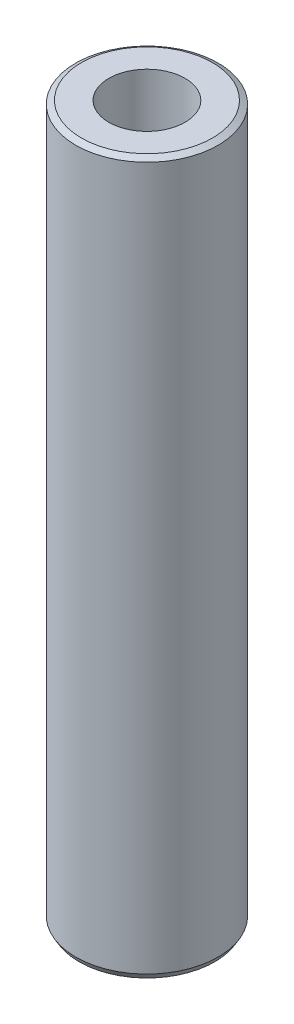
ISO-10303-21;
HEADER;
FILE_DESCRIPTION(('STEP AP214'),'2;1');
FILE_NAME('part.step','',(''),(''),'','','');
FILE_SCHEMA(('AUTOMOTIVE_DESIGN { 1 0 10303 214 1 1 1 1 }'));
ENDSEC;
DATA;
#1=APPLICATION_CONTEXT('core data for automotive mechanical design processes');
#2=APPLICATION_PROTOCOL_DEFINITION('international standard','automotive_design',2000,#1);
#3=PRODUCT_CONTEXT('',#1,'mechanical');
#4=PRODUCT('Part','Part','',(#3));
#5=PRODUCT_RELATED_PRODUCT_CATEGORY('part','',(#4));
#6=PRODUCT_DEFINITION_FORMATION('','',#4);
#7=PRODUCT_DEFINITION_CONTEXT('part definition',#1,'design');
#8=PRODUCT_DEFINITION('design','',#6,#7);
#9=PRODUCT_DEFINITION_SHAPE('','',#8);
#10=(LENGTH_UNIT() NAMED_UNIT(*) SI_UNIT(.MILLI.,.METRE.));
#11=(NAMED_UNIT(*) PLANE_ANGLE_UNIT() SI_UNIT($,.RADIAN.));
#12=(NAMED_UNIT(*) SI_UNIT($,.STERADIAN.) SOLID_ANGLE_UNIT());
#13=UNCERTAINTY_MEASURE_WITH_UNIT(LENGTH_MEASURE(1.E-05),#10,'distance_accuracy_value','');
#14=(GEOMETRIC_REPRESENTATION_CONTEXT(3) GLOBAL_UNCERTAINTY_ASSIGNED_CONTEXT((#13)) GLOBAL_UNIT_ASSIGNED_CONTEXT((#10,
#11,#12)) REPRESENTATION_CONTEXT('',''));
#15=CARTESIAN_POINT('',(0.,0.,0.));
#16=DIRECTION('',(0.,0.,1.));
#17=DIRECTION('',(1.,0.,0.));
#18=AXIS2_PLACEMENT_3D('',#15,#16,#17);
#19=CARTESIAN_POINT('',(0.,600.,0.));
#20=DIRECTION('',(0.,-1.,0.));
#21=DIRECTION('',(0.,0.,-1.));
#22=AXIS2_PLACEMENT_3D('',#19,#20,#21);
#23=CYLINDRICAL_SURFACE('',#22,60.);
#24=CARTESIAN_POINT('',(0.,597.195413019165,0.));
#25=DIRECTION('',(0.,1.,0.));
#26=DIRECTION('',(0.,0.,1.));
#27=AXIS2_PLACEMENT_3D('',#24,#25,#26);
#28=CIRCLE('',#27,60.);
#29=CARTESIAN_POINT('',(0.,597.195413019165,60.));
#30=VERTEX_POINT('',#29);
#31=EDGE_CURVE('E50',#30,#30,#28,.F.);
#32=ORIENTED_EDGE('',*,*,#31,.T.);
#33=EDGE_LOOP('',(#32));
#34=FACE_BOUND('',#33,.T.);
#35=CARTESIAN_POINT('',(0.,4.85768714505286,0.));
#36=DIRECTION('',(0.,1.,0.));
#37=DIRECTION('',(0.,0.,1.));
#38=AXIS2_PLACEMENT_3D('',#35,#36,#37);
#39=CIRCLE('',#38,60.);
#40=CARTESIAN_POINT('',(0.,4.85768714505286,60.));
#41=VERTEX_POINT('',#40);
#42=EDGE_CURVE('E51',#41,#41,#39,.T.);
#43=ORIENTED_EDGE('',*,*,#42,.T.);
#44=EDGE_LOOP('',(#43));
#45=FACE_BOUND('',#44,.T.);
#46=ADVANCED_FACE('F39',(#34,#45),#23,.T.);
#47=CARTESIAN_POINT('',(0.,600.,0.));
#48=DIRECTION('',(0.,1.,0.));
#49=DIRECTION('',(0.,0.,1.));
#50=AXIS2_PLACEMENT_3D('',#47,#48,#49);
#51=PLANE('',#50);
#52=CARTESIAN_POINT('',(0.,600.,0.));
#53=DIRECTION('',(0.,1.,0.));
#54=DIRECTION('',(0.,0.,1.));
#55=AXIS2_PLACEMENT_3D('',#52,#53,#54);
#56=CIRCLE('',#55,55.1423128549473);
#57=CARTESIAN_POINT('',(0.,600.,55.1423128549473));
#58=VERTEX_POINT('',#57);
#59=EDGE_CURVE('E54',#58,#58,#56,.T.);
#60=ORIENTED_EDGE('',*,*,#59,.T.);
#61=EDGE_LOOP('',(#60));
#62=FACE_BOUND('',#61,.T.);
#63=CARTESIAN_POINT('',(0.,600.,0.));
#64=DIRECTION('',(0.,1.,0.));
#65=DIRECTION('',(0.,0.,1.));
#66=AXIS2_PLACEMENT_3D('',#63,#64,#65);
#67=CIRCLE('',#66,32.1248528380682);
#68=CARTESIAN_POINT('',(0.,600.,32.1248528380682));
#69=VERTEX_POINT('',#68);
#70=EDGE_CURVE('E58',#69,#69,#67,.T.);
#71=ORIENTED_EDGE('',*,*,#70,.F.);
#72=EDGE_LOOP('',(#71));
#73=FACE_BOUND('',#72,.T.);
#74=ADVANCED_FACE('F69',(#62,#73),#51,.T.);
#75=CARTESIAN_POINT('',(0.,0.,0.));
#76=DIRECTION('',(0.,1.,0.));
#77=DIRECTION('',(0.,0.,1.));
#78=AXIS2_PLACEMENT_3D('',#75,#76,#77);
#79=PLANE('',#78);
#80=CARTESIAN_POINT('',(0.,0.,0.));
#81=DIRECTION('',(0.,1.,0.));
#82=DIRECTION('',(0.,0.,1.));
#83=AXIS2_PLACEMENT_3D('',#80,#81,#82);
#84=CIRCLE('',#83,57.1954130191647);
#85=CARTESIAN_POINT('',(0.,0.,57.1954130191647));
#86=VERTEX_POINT('',#85);
#87=EDGE_CURVE('E10',#86,#86,#84,.F.);
#88=ORIENTED_EDGE('',*,*,#87,.T.);
#89=EDGE_LOOP('',(#88));
#90=FACE_BOUND('',#89,.T.);
#91=CARTESIAN_POINT('',(0.,0.,0.));
#92=DIRECTION('',(0.,1.,0.));
#93=DIRECTION('',(0.,0.,1.));
#94=AXIS2_PLACEMENT_3D('',#91,#92,#93);
#95=CIRCLE('',#94,32.1248528380682);
#96=CARTESIAN_POINT('',(0.,0.,32.1248528380682));
#97=VERTEX_POINT('',#96);
#98=EDGE_CURVE('E63',#97,#97,#95,.T.);
#99=ORIENTED_EDGE('',*,*,#98,.T.);
#100=EDGE_LOOP('',(#99));
#101=FACE_BOUND('',#100,.T.);
#102=ADVANCED_FACE('F75',(#90,#101),#79,.F.);
#103=CARTESIAN_POINT('',(0.,600.,0.));
#104=DIRECTION('',(0.,-1.,0.));
#105=DIRECTION('',(0.,0.,-1.));
#106=AXIS2_PLACEMENT_3D('',#103,#104,#105);
#107=CYLINDRICAL_SURFACE('',#106,32.1248528380682);
#108=ORIENTED_EDGE('',*,*,#70,.T.);
#109=EDGE_LOOP('',(#108));
#110=FACE_BOUND('',#109,.T.);
#111=ORIENTED_EDGE('',*,*,#98,.F.);
#112=EDGE_LOOP('',(#111));
#113=FACE_BOUND('',#112,.T.);
#114=ADVANCED_FACE('F70',(#110,#113),#107,.F.);
#115=CARTESIAN_POINT('',(0.,600.,0.));
#116=DIRECTION('',(0.,-1.,0.));
#117=DIRECTION('',(0.,0.,-1.));
#118=AXIS2_PLACEMENT_3D('',#115,#116,#117);
#119=CONICAL_SURFACE('',#118,55.1423128549473,1.04719755119661);
#120=ORIENTED_EDGE('',*,*,#31,.F.);
#121=EDGE_LOOP('',(#120));
#122=FACE_BOUND('',#121,.T.);
#123=ORIENTED_EDGE('',*,*,#59,.F.);
#124=EDGE_LOOP('',(#123));
#125=FACE_BOUND('',#124,.T.);
#126=ADVANCED_FACE('F81',(#122,#125),#119,.T.);
#127=CARTESIAN_POINT('',(0.,4.85768714505286,0.));
#128=DIRECTION('',(0.,1.,0.));
#129=DIRECTION('',(0.,0.,1.));
#130=AXIS2_PLACEMENT_3D('',#127,#128,#129);
#131=CONICAL_SURFACE('',#130,60.,0.523598775598306);
#132=ORIENTED_EDGE('',*,*,#87,.F.);
#133=EDGE_LOOP('',(#132));
#134=FACE_BOUND('',#133,.T.);
#135=ORIENTED_EDGE('',*,*,#42,.F.);
#136=EDGE_LOOP('',(#135));
#137=FACE_BOUND('',#136,.T.);
#138=ADVANCED_FACE('F45',(#134,#137),#131,.T.);
#139=CLOSED_SHELL('',(#46,#74,#102,#114,#126,#138));
#140=MANIFOLD_SOLID_BREP('B2',#139);
#141=ADVANCED_BREP_SHAPE_REPRESENTATION('',(#18,#140),#14);
#142=SHAPE_DEFINITION_REPRESENTATION(#9,#141);
ENDSEC;
END-ISO-10303-21;
